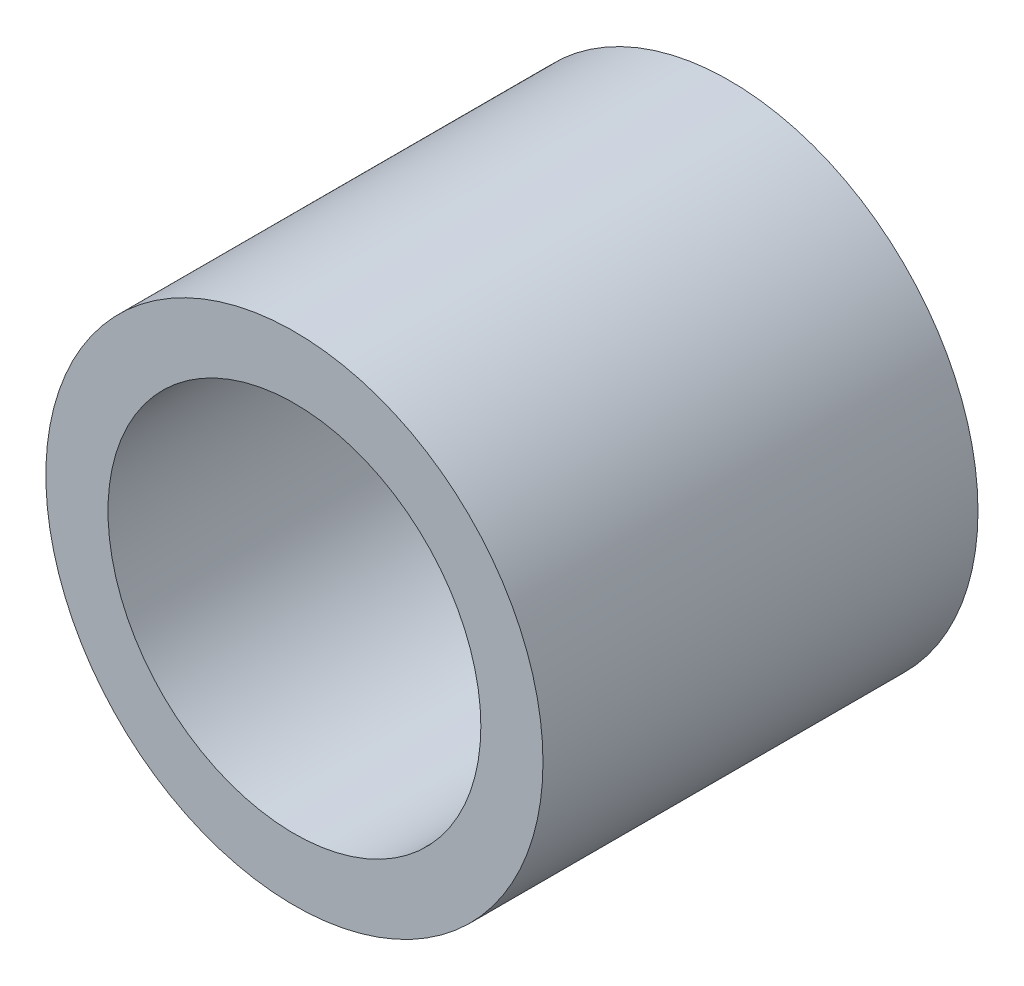
ISO-10303-21;
HEADER;
FILE_DESCRIPTION(('STEP AP214'),'2;1');
FILE_NAME('part.step','',(''),(''),'','','');
FILE_SCHEMA(('AUTOMOTIVE_DESIGN { 1 0 10303 214 1 1 1 1 }'));
ENDSEC;
DATA;
#1=APPLICATION_CONTEXT('core data for automotive mechanical design processes');
#2=APPLICATION_PROTOCOL_DEFINITION('international standard','automotive_design',2000,#1);
#3=PRODUCT_CONTEXT('',#1,'mechanical');
#4=PRODUCT('Part','Part','',(#3));
#5=PRODUCT_RELATED_PRODUCT_CATEGORY('part','',(#4));
#6=PRODUCT_DEFINITION_FORMATION('','',#4);
#7=PRODUCT_DEFINITION_CONTEXT('part definition',#1,'design');
#8=PRODUCT_DEFINITION('design','',#6,#7);
#9=PRODUCT_DEFINITION_SHAPE('','',#8);
#10=(LENGTH_UNIT() NAMED_UNIT(*) SI_UNIT(.MILLI.,.METRE.));
#11=(NAMED_UNIT(*) PLANE_ANGLE_UNIT() SI_UNIT($,.RADIAN.));
#12=(NAMED_UNIT(*) SI_UNIT($,.STERADIAN.) SOLID_ANGLE_UNIT());
#13=UNCERTAINTY_MEASURE_WITH_UNIT(LENGTH_MEASURE(1.E-05),#10,'distance_accuracy_value','');
#14=(GEOMETRIC_REPRESENTATION_CONTEXT(3) GLOBAL_UNCERTAINTY_ASSIGNED_CONTEXT((#13)) GLOBAL_UNIT_ASSIGNED_CONTEXT((#10,
#11,#12)) REPRESENTATION_CONTEXT('',''));
#15=CARTESIAN_POINT('',(0.,0.,0.));
#16=DIRECTION('',(0.,0.,1.));
#17=DIRECTION('',(1.,0.,0.));
#18=AXIS2_PLACEMENT_3D('',#15,#16,#17);
#19=CARTESIAN_POINT('',(0.,0.,7.));
#20=DIRECTION('',(0.,0.,-1.));
#21=DIRECTION('',(-1.,0.,0.));
#22=AXIS2_PLACEMENT_3D('',#19,#20,#21);
#23=CYLINDRICAL_SURFACE('',#22,1.9);
#24=CARTESIAN_POINT('',(0.,0.,0.));
#25=DIRECTION('',(0.,0.,1.));
#26=DIRECTION('',(1.,0.,0.));
#27=AXIS2_PLACEMENT_3D('',#24,#25,#26);
#28=CIRCLE('',#27,1.9);
#29=CARTESIAN_POINT('',(1.9,0.,0.));
#30=VERTEX_POINT('',#29);
#31=EDGE_CURVE('E43',#30,#30,#28,.T.);
#32=ORIENTED_EDGE('',*,*,#31,.F.);
#33=EDGE_LOOP('',(#32));
#34=FACE_BOUND('',#33,.T.);
#35=CARTESIAN_POINT('',(0.,0.,2.));
#36=DIRECTION('',(0.,0.,1.));
#37=DIRECTION('',(1.,0.,0.));
#38=AXIS2_PLACEMENT_3D('',#35,#36,#37);
#39=CIRCLE('',#38,1.9);
#40=CARTESIAN_POINT('',(1.9,0.,2.));
#41=VERTEX_POINT('',#40);
#42=EDGE_CURVE('E34',#41,#41,#39,.T.);
#43=ORIENTED_EDGE('',*,*,#42,.T.);
#44=EDGE_LOOP('',(#43));
#45=FACE_BOUND('',#44,.T.);
#46=ADVANCED_FACE('F30',(#34,#45),#23,.F.);
#47=CARTESIAN_POINT('',(0.,0.,7.));
#48=DIRECTION('',(0.,0.,1.));
#49=DIRECTION('',(1.,0.,0.));
#50=AXIS2_PLACEMENT_3D('',#47,#48,#49);
#51=PLANE('',#50);
#52=CARTESIAN_POINT('',(0.,0.,7.));
#53=DIRECTION('',(0.,0.,1.));
#54=DIRECTION('',(1.,0.,0.));
#55=AXIS2_PLACEMENT_3D('',#52,#53,#54);
#56=CIRCLE('',#55,3.);
#57=CARTESIAN_POINT('',(3.,0.,7.));
#58=VERTEX_POINT('',#57);
#59=EDGE_CURVE('E47',#58,#58,#56,.T.);
#60=ORIENTED_EDGE('',*,*,#59,.F.);
#61=EDGE_LOOP('',(#60));
#62=FACE_BOUND('',#61,.T.);
#63=CARTESIAN_POINT('',(0.,0.,7.));
#64=DIRECTION('',(0.,0.,1.));
#65=DIRECTION('',(1.,0.,0.));
#66=AXIS2_PLACEMENT_3D('',#63,#64,#65);
#67=CIRCLE('',#66,4.);
#68=CARTESIAN_POINT('',(4.,0.,7.));
#69=VERTEX_POINT('',#68);
#70=EDGE_CURVE('E10',#69,#69,#67,.T.);
#71=ORIENTED_EDGE('',*,*,#70,.T.);
#72=EDGE_LOOP('',(#71));
#73=FACE_BOUND('',#72,.T.);
#74=ADVANCED_FACE('F68',(#62,#73),#51,.T.);
#75=CARTESIAN_POINT('',(0.,0.,0.));
#76=DIRECTION('',(0.,0.,1.));
#77=DIRECTION('',(1.,0.,0.));
#78=AXIS2_PLACEMENT_3D('',#75,#76,#77);
#79=PLANE('',#78);
#80=CARTESIAN_POINT('',(0.,0.,0.));
#81=DIRECTION('',(0.,0.,1.));
#82=DIRECTION('',(1.,0.,0.));
#83=AXIS2_PLACEMENT_3D('',#80,#81,#82);
#84=CIRCLE('',#83,4.);
#85=CARTESIAN_POINT('',(4.,0.,0.));
#86=VERTEX_POINT('',#85);
#87=EDGE_CURVE('E38',#86,#86,#84,.T.);
#88=ORIENTED_EDGE('',*,*,#87,.F.);
#89=EDGE_LOOP('',(#88));
#90=FACE_BOUND('',#89,.T.);
#91=ORIENTED_EDGE('',*,*,#31,.T.);
#92=EDGE_LOOP('',(#91));
#93=FACE_BOUND('',#92,.T.);
#94=ADVANCED_FACE('F74',(#90,#93),#79,.F.);
#95=CARTESIAN_POINT('',(0.,0.,7.));
#96=DIRECTION('',(0.,0.,-1.));
#97=DIRECTION('',(-1.,0.,0.));
#98=AXIS2_PLACEMENT_3D('',#95,#96,#97);
#99=CYLINDRICAL_SURFACE('',#98,4.);
#100=ORIENTED_EDGE('',*,*,#70,.F.);
#101=EDGE_LOOP('',(#100));
#102=FACE_BOUND('',#101,.T.);
#103=ORIENTED_EDGE('',*,*,#87,.T.);
#104=EDGE_LOOP('',(#103));
#105=FACE_BOUND('',#104,.T.);
#106=ADVANCED_FACE('F32',(#102,#105),#99,.T.);
#107=CARTESIAN_POINT('',(0.,0.,2.));
#108=DIRECTION('',(0.,0.,1.));
#109=DIRECTION('',(1.,0.,0.));
#110=AXIS2_PLACEMENT_3D('',#107,#108,#109);
#111=CYLINDRICAL_SURFACE('',#110,3.);
#112=CARTESIAN_POINT('',(0.,0.,2.));
#113=DIRECTION('',(0.,0.,1.));
#114=DIRECTION('',(1.,0.,0.));
#115=AXIS2_PLACEMENT_3D('',#112,#113,#114);
#116=CIRCLE('',#115,3.);
#117=CARTESIAN_POINT('',(3.,0.,2.));
#118=VERTEX_POINT('',#117);
#119=EDGE_CURVE('E50',#118,#118,#116,.T.);
#120=ORIENTED_EDGE('',*,*,#119,.F.);
#121=EDGE_LOOP('',(#120));
#122=FACE_BOUND('',#121,.T.);
#123=ORIENTED_EDGE('',*,*,#59,.T.);
#124=EDGE_LOOP('',(#123));
#125=FACE_BOUND('',#124,.T.);
#126=ADVANCED_FACE('F60',(#122,#125),#111,.F.);
#127=CARTESIAN_POINT('',(0.,0.,2.));
#128=DIRECTION('',(0.,0.,1.));
#129=DIRECTION('',(1.,0.,0.));
#130=AXIS2_PLACEMENT_3D('',#127,#128,#129);
#131=PLANE('',#130);
#132=ORIENTED_EDGE('',*,*,#42,.F.);
#133=EDGE_LOOP('',(#132));
#134=FACE_BOUND('',#133,.T.);
#135=ORIENTED_EDGE('',*,*,#119,.T.);
#136=EDGE_LOOP('',(#135));
#137=FACE_BOUND('',#136,.T.);
#138=ADVANCED_FACE('F58',(#134,#137),#131,.T.);
#139=CLOSED_SHELL('',(#46,#74,#94,#106,#126,#138));
#140=MANIFOLD_SOLID_BREP('B2',#139);
#141=ADVANCED_BREP_SHAPE_REPRESENTATION('',(#18,#140),#14);
#142=SHAPE_DEFINITION_REPRESENTATION(#9,#141);
ENDSEC;
END-ISO-10303-21;
